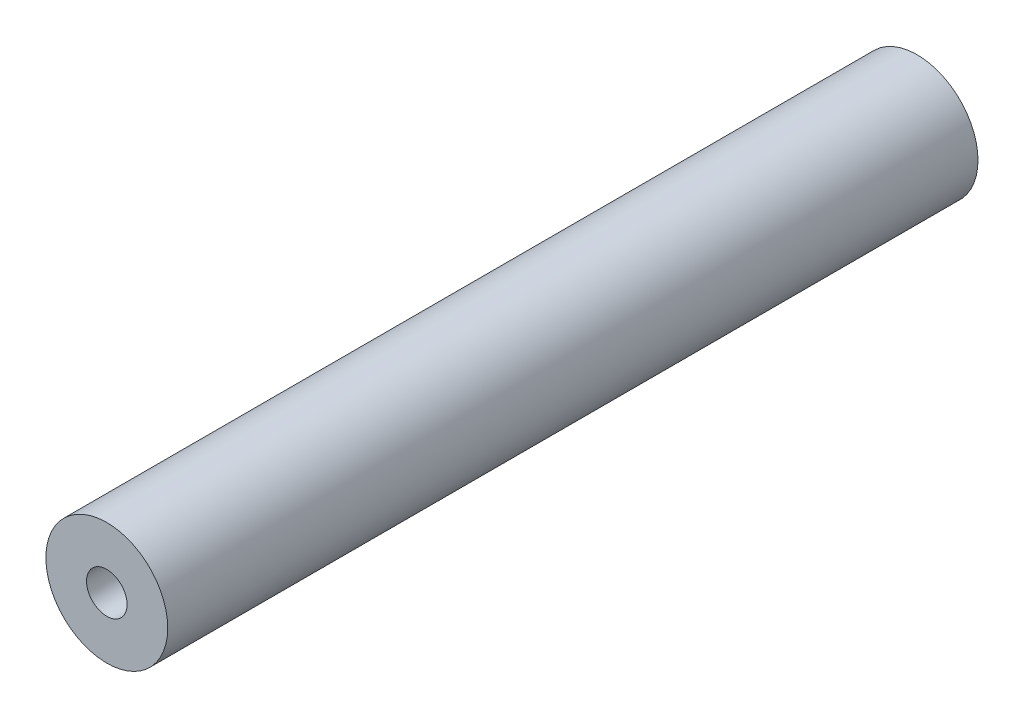
ISO-10303-21;
HEADER;
FILE_DESCRIPTION(('STEP AP214'),'2;1');
FILE_NAME('part.step','',(''),(''),'','','');
FILE_SCHEMA(('AUTOMOTIVE_DESIGN { 1 0 10303 214 1 1 1 1 }'));
ENDSEC;
DATA;
#1=APPLICATION_CONTEXT('core data for automotive mechanical design processes');
#2=APPLICATION_PROTOCOL_DEFINITION('international standard','automotive_design',2000,#1);
#3=PRODUCT_CONTEXT('',#1,'mechanical');
#4=PRODUCT('Part','Part','',(#3));
#5=PRODUCT_RELATED_PRODUCT_CATEGORY('part','',(#4));
#6=PRODUCT_DEFINITION_FORMATION('','',#4);
#7=PRODUCT_DEFINITION_CONTEXT('part definition',#1,'design');
#8=PRODUCT_DEFINITION('design','',#6,#7);
#9=PRODUCT_DEFINITION_SHAPE('','',#8);
#10=(LENGTH_UNIT() NAMED_UNIT(*) SI_UNIT(.MILLI.,.METRE.));
#11=(NAMED_UNIT(*) PLANE_ANGLE_UNIT() SI_UNIT($,.RADIAN.));
#12=(NAMED_UNIT(*) SI_UNIT($,.STERADIAN.) SOLID_ANGLE_UNIT());
#13=UNCERTAINTY_MEASURE_WITH_UNIT(LENGTH_MEASURE(1.E-05),#10,'distance_accuracy_value','');
#14=(GEOMETRIC_REPRESENTATION_CONTEXT(3) GLOBAL_UNCERTAINTY_ASSIGNED_CONTEXT((#13)) GLOBAL_UNIT_ASSIGNED_CONTEXT((#10,
#11,#12)) REPRESENTATION_CONTEXT('',''));
#15=CARTESIAN_POINT('',(0.,0.,0.));
#16=DIRECTION('',(0.,0.,1.));
#17=DIRECTION('',(1.,0.,0.));
#18=AXIS2_PLACEMENT_3D('',#15,#16,#17);
#19=CARTESIAN_POINT('',(0.,0.,-50.673));
#20=DIRECTION('',(0.,0.,1.));
#21=DIRECTION('',(1.,0.,0.));
#22=AXIS2_PLACEMENT_3D('',#19,#20,#21);
#23=CYLINDRICAL_SURFACE('',#22,3.81);
#24=CARTESIAN_POINT('',(0.,0.,-50.673));
#25=DIRECTION('',(0.,0.,1.));
#26=DIRECTION('',(1.,0.,0.));
#27=AXIS2_PLACEMENT_3D('',#24,#25,#26);
#28=CIRCLE('',#27,3.81);
#29=CARTESIAN_POINT('',(3.81,0.,-50.673));
#30=VERTEX_POINT('',#29);
#31=EDGE_CURVE('E10',#30,#30,#28,.T.);
#32=ORIENTED_EDGE('',*,*,#31,.T.);
#33=EDGE_LOOP('',(#32));
#34=FACE_BOUND('',#33,.T.);
#35=CARTESIAN_POINT('',(0.,0.,0.));
#36=DIRECTION('',(0.,0.,1.));
#37=DIRECTION('',(1.,0.,0.));
#38=AXIS2_PLACEMENT_3D('',#35,#36,#37);
#39=CIRCLE('',#38,3.81);
#40=CARTESIAN_POINT('',(3.81,0.,0.));
#41=VERTEX_POINT('',#40);
#42=EDGE_CURVE('E40',#41,#41,#39,.T.);
#43=ORIENTED_EDGE('',*,*,#42,.F.);
#44=EDGE_LOOP('',(#43));
#45=FACE_BOUND('',#44,.T.);
#46=ADVANCED_FACE('F37',(#34,#45),#23,.T.);
#47=CARTESIAN_POINT('',(0.,0.,-50.673));
#48=DIRECTION('',(0.,0.,1.));
#49=DIRECTION('',(1.,0.,0.));
#50=AXIS2_PLACEMENT_3D('',#47,#48,#49);
#51=PLANE('',#50);
#52=CARTESIAN_POINT('',(0.,0.,-50.673));
#53=DIRECTION('',(0.,0.,1.));
#54=DIRECTION('',(1.,0.,0.));
#55=AXIS2_PLACEMENT_3D('',#52,#53,#54);
#56=CIRCLE('',#55,1.27);
#57=CARTESIAN_POINT('',(1.27,0.,-50.673));
#58=VERTEX_POINT('',#57);
#59=EDGE_CURVE('E47',#58,#58,#56,.T.);
#60=ORIENTED_EDGE('',*,*,#59,.T.);
#61=EDGE_LOOP('',(#60));
#62=FACE_BOUND('',#61,.T.);
#63=ORIENTED_EDGE('',*,*,#31,.F.);
#64=EDGE_LOOP('',(#63));
#65=FACE_BOUND('',#64,.T.);
#66=ADVANCED_FACE('F55',(#62,#65),#51,.F.);
#67=CARTESIAN_POINT('',(0.,0.,0.));
#68=DIRECTION('',(0.,0.,1.));
#69=DIRECTION('',(1.,0.,0.));
#70=AXIS2_PLACEMENT_3D('',#67,#68,#69);
#71=PLANE('',#70);
#72=CARTESIAN_POINT('',(0.,0.,0.));
#73=DIRECTION('',(0.,0.,1.));
#74=DIRECTION('',(1.,0.,0.));
#75=AXIS2_PLACEMENT_3D('',#72,#73,#74);
#76=CIRCLE('',#75,1.27);
#77=CARTESIAN_POINT('',(1.27,0.,0.));
#78=VERTEX_POINT('',#77);
#79=EDGE_CURVE('E49',#78,#78,#76,.T.);
#80=ORIENTED_EDGE('',*,*,#79,.F.);
#81=EDGE_LOOP('',(#80));
#82=FACE_BOUND('',#81,.T.);
#83=ORIENTED_EDGE('',*,*,#42,.T.);
#84=EDGE_LOOP('',(#83));
#85=FACE_BOUND('',#84,.T.);
#86=ADVANCED_FACE('F61',(#82,#85),#71,.T.);
#87=CARTESIAN_POINT('',(0.,0.,-50.673));
#88=DIRECTION('',(0.,0.,1.));
#89=DIRECTION('',(1.,0.,0.));
#90=AXIS2_PLACEMENT_3D('',#87,#88,#89);
#91=CYLINDRICAL_SURFACE('',#90,1.27);
#92=ORIENTED_EDGE('',*,*,#59,.F.);
#93=EDGE_LOOP('',(#92));
#94=FACE_BOUND('',#93,.T.);
#95=ORIENTED_EDGE('',*,*,#79,.T.);
#96=EDGE_LOOP('',(#95));
#97=FACE_BOUND('',#96,.T.);
#98=ADVANCED_FACE('F58',(#94,#97),#91,.F.);
#99=CLOSED_SHELL('',(#46,#66,#86,#98));
#100=MANIFOLD_SOLID_BREP('B2',#99);
#101=ADVANCED_BREP_SHAPE_REPRESENTATION('',(#18,#100),#14);
#102=SHAPE_DEFINITION_REPRESENTATION(#9,#101);
ENDSEC;
END-ISO-10303-21;
